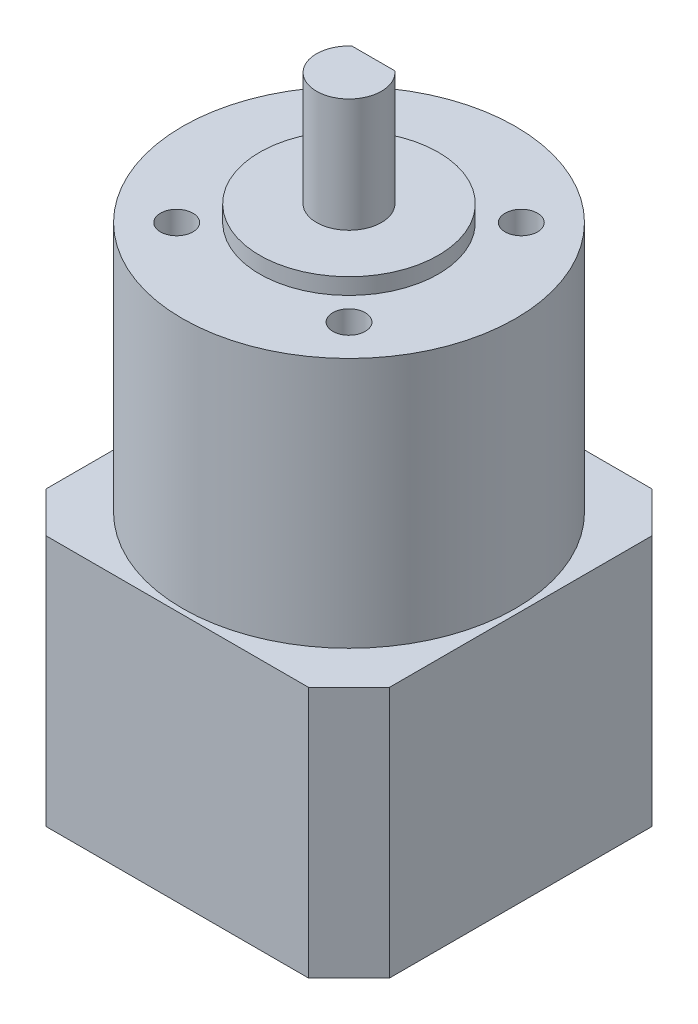
ISO-10303-21;
HEADER;
FILE_DESCRIPTION(('STEP AP214'),'2;1');
FILE_NAME('part.step','',(''),(''),'','','');
FILE_SCHEMA(('AUTOMOTIVE_DESIGN { 1 0 10303 214 1 1 1 1 }'));
ENDSEC;
DATA;
#1=APPLICATION_CONTEXT('core data for automotive mechanical design processes');
#2=APPLICATION_PROTOCOL_DEFINITION('international standard','automotive_design',2000,#1);
#3=PRODUCT_CONTEXT('',#1,'mechanical');
#4=PRODUCT('Part','Part','',(#3));
#5=PRODUCT_RELATED_PRODUCT_CATEGORY('part','',(#4));
#6=PRODUCT_DEFINITION_FORMATION('','',#4);
#7=PRODUCT_DEFINITION_CONTEXT('part definition',#1,'design');
#8=PRODUCT_DEFINITION('design','',#6,#7);
#9=PRODUCT_DEFINITION_SHAPE('','',#8);
#10=(LENGTH_UNIT() NAMED_UNIT(*) SI_UNIT(.MILLI.,.METRE.));
#11=(NAMED_UNIT(*) PLANE_ANGLE_UNIT() SI_UNIT($,.RADIAN.));
#12=(NAMED_UNIT(*) SI_UNIT($,.STERADIAN.) SOLID_ANGLE_UNIT());
#13=UNCERTAINTY_MEASURE_WITH_UNIT(LENGTH_MEASURE(1.E-05),#10,'distance_accuracy_value','');
#14=(GEOMETRIC_REPRESENTATION_CONTEXT(3) GLOBAL_UNCERTAINTY_ASSIGNED_CONTEXT((#13)) GLOBAL_UNIT_ASSIGNED_CONTEXT((#10,
#11,#12)) REPRESENTATION_CONTEXT('',''));
#15=CARTESIAN_POINT('',(0.,0.,0.));
#16=DIRECTION('',(0.,0.,1.));
#17=DIRECTION('',(1.,0.,0.));
#18=AXIS2_PLACEMENT_3D('',#15,#16,#17);
#19=CARTESIAN_POINT('',(0.,16.,0.));
#20=DIRECTION('',(0.,1.,0.));
#21=DIRECTION('',(0.,0.,1.));
#22=AXIS2_PLACEMENT_3D('',#19,#20,#21);
#23=PLANE('',#22);
#24=DIRECTION('',(1.,0.,0.));
#25=VECTOR('',#24,1.);
#26=CARTESIAN_POINT('',(-2.64575131106459,16.,-3.));
#27=LINE('',#26,#25);
#28=CARTESIAN_POINT('',(2.64575131106459,16.,-3.));
#29=VERTEX_POINT('',#28);
#30=CARTESIAN_POINT('',(-2.64575131106459,16.,-3.));
#31=VERTEX_POINT('',#30);
#32=EDGE_CURVE('E105',#29,#31,#27,.F.);
#33=ORIENTED_EDGE('',*,*,#32,.T.);
#34=CARTESIAN_POINT('',(0.,16.,0.));
#35=DIRECTION('',(0.,-1.,0.));
#36=DIRECTION('',(0.,0.,-1.));
#37=AXIS2_PLACEMENT_3D('',#34,#35,#36);
#38=CIRCLE('',#37,4.);
#39=EDGE_CURVE('E20',#29,#31,#38,.T.);
#40=ORIENTED_EDGE('',*,*,#39,.F.);
#41=EDGE_LOOP('',(#33,#40));
#42=FACE_BOUND('',#41,.T.);
#43=ADVANCED_FACE('F17',(#42),#23,.T.);
#44=CARTESIAN_POINT('',(0.,3.,0.));
#45=DIRECTION('',(0.,-1.,0.));
#46=DIRECTION('',(0.,0.,-1.));
#47=AXIS2_PLACEMENT_3D('',#44,#45,#46);
#48=PLANE('',#47);
#49=CARTESIAN_POINT('',(0.,3.,0.));
#50=DIRECTION('',(0.,-1.,0.));
#51=DIRECTION('',(0.,0.,-1.));
#52=AXIS2_PLACEMENT_3D('',#49,#50,#51);
#53=CIRCLE('',#52,4.);
#54=CARTESIAN_POINT('',(-2.64575131106459,3.,-3.));
#55=VERTEX_POINT('',#54);
#56=CARTESIAN_POINT('',(2.64575131106459,3.,-3.));
#57=VERTEX_POINT('',#56);
#58=EDGE_CURVE('E91',#55,#57,#53,.T.);
#59=ORIENTED_EDGE('',*,*,#58,.F.);
#60=DIRECTION('',(1.,0.,0.));
#61=VECTOR('',#60,1.);
#62=CARTESIAN_POINT('',(-2.64575131106459,3.,-3.));
#63=LINE('',#62,#61);
#64=EDGE_CURVE('E107',#55,#57,#63,.T.);
#65=ORIENTED_EDGE('',*,*,#64,.T.);
#66=EDGE_LOOP('',(#59,#65));
#67=FACE_BOUND('',#66,.T.);
#68=ADVANCED_FACE('F154',(#67),#48,.F.);
#69=CARTESIAN_POINT('',(-2.64575131106459,3.,-3.));
#70=DIRECTION('',(0.,0.,1.));
#71=DIRECTION('',(1.,0.,0.));
#72=AXIS2_PLACEMENT_3D('',#69,#70,#71);
#73=PLANE('',#72);
#74=DIRECTION('',(0.,-1.,0.));
#75=VECTOR('',#74,1.);
#76=CARTESIAN_POINT('',(2.64575131106459,16.,-3.));
#77=LINE('',#76,#75);
#78=EDGE_CURVE('E102',#57,#29,#77,.F.);
#79=ORIENTED_EDGE('',*,*,#78,.F.);
#80=ORIENTED_EDGE('',*,*,#64,.F.);
#81=DIRECTION('',(0.,-1.,0.));
#82=VECTOR('',#81,1.);
#83=CARTESIAN_POINT('',(-2.64575131106459,16.,-3.));
#84=LINE('',#83,#82);
#85=EDGE_CURVE('E100',#31,#55,#84,.T.);
#86=ORIENTED_EDGE('',*,*,#85,.F.);
#87=ORIENTED_EDGE('',*,*,#32,.F.);
#88=EDGE_LOOP('',(#79,#80,#86,#87));
#89=FACE_BOUND('',#88,.T.);
#90=ADVANCED_FACE('F109',(#89),#73,.F.);
#91=CARTESIAN_POINT('',(0.,16.,0.));
#92=DIRECTION('',(0.,-1.,0.));
#93=DIRECTION('',(0.,0.,-1.));
#94=AXIS2_PLACEMENT_3D('',#91,#92,#93);
#95=CYLINDRICAL_SURFACE('',#94,4.);
#96=CARTESIAN_POINT('',(0.,2.,0.));
#97=DIRECTION('',(0.,-1.,0.));
#98=DIRECTION('',(0.,0.,-1.));
#99=AXIS2_PLACEMENT_3D('',#96,#97,#98);
#100=CIRCLE('',#99,4.);
#101=CARTESIAN_POINT('',(0.,2.,-4.));
#102=VERTEX_POINT('',#101);
#103=EDGE_CURVE('E148',#102,#102,#100,.T.);
#104=ORIENTED_EDGE('',*,*,#103,.F.);
#105=EDGE_LOOP('',(#104));
#106=FACE_BOUND('',#105,.T.);
#107=ORIENTED_EDGE('',*,*,#58,.T.);
#108=ORIENTED_EDGE('',*,*,#78,.T.);
#109=ORIENTED_EDGE('',*,*,#39,.T.);
#110=ORIENTED_EDGE('',*,*,#85,.T.);
#111=EDGE_LOOP('',(#107,#108,#109,#110));
#112=FACE_BOUND('',#111,.T.);
#113=ADVANCED_FACE('F98',(#106,#112),#95,.T.);
#114=CARTESIAN_POINT('',(-16.15,-61.9,-16.15));
#115=DIRECTION('',(0.,-1.,0.));
#116=DIRECTION('',(0.,0.,-1.));
#117=AXIS2_PLACEMENT_3D('',#114,#115,#116);
#118=PLANE('',#117);
#119=DIRECTION('',(0.,0.,1.));
#120=VECTOR('',#119,1.);
#121=CARTESIAN_POINT('',(21.15,-61.9,16.15));
#122=LINE('',#121,#120);
#123=CARTESIAN_POINT('',(21.15,-61.9,-16.15));
#124=VERTEX_POINT('',#123);
#125=CARTESIAN_POINT('',(21.15,-61.9,16.1500000000001));
#126=VERTEX_POINT('',#125);
#127=EDGE_CURVE('E419',#124,#126,#122,.T.);
#128=ORIENTED_EDGE('',*,*,#127,.T.);
#129=DIRECTION('',(0.707106781186552,0.,-0.707106781186543));
#130=VECTOR('',#129,1.);
#131=CARTESIAN_POINT('',(21.1499999999999,-61.9,16.1500000000001));
#132=LINE('',#131,#130);
#133=CARTESIAN_POINT('',(16.1499999999999,-61.9,21.15));
#134=VERTEX_POINT('',#133);
#135=EDGE_CURVE('E422',#134,#126,#132,.T.);
#136=ORIENTED_EDGE('',*,*,#135,.F.);
#137=DIRECTION('',(-1.,0.,0.));
#138=VECTOR('',#137,1.);
#139=CARTESIAN_POINT('',(-16.15,-61.9,21.15));
#140=LINE('',#139,#138);
#141=CARTESIAN_POINT('',(-16.1500000000001,-61.9,21.15));
#142=VERTEX_POINT('',#141);
#143=EDGE_CURVE('E439',#134,#142,#140,.T.);
#144=ORIENTED_EDGE('',*,*,#143,.T.);
#145=DIRECTION('',(0.70710678118654,0.,0.707106781186555));
#146=VECTOR('',#145,1.);
#147=CARTESIAN_POINT('',(-16.1500000000002,-61.9,21.1499999999998));
#148=LINE('',#147,#146);
#149=CARTESIAN_POINT('',(-21.15,-61.9,16.1499999999999));
#150=VERTEX_POINT('',#149);
#151=EDGE_CURVE('E147',#150,#142,#148,.T.);
#152=ORIENTED_EDGE('',*,*,#151,.F.);
#153=DIRECTION('',(0.,0.,-1.));
#154=VECTOR('',#153,1.);
#155=CARTESIAN_POINT('',(-21.15,-61.9,16.15));
#156=LINE('',#155,#154);
#157=CARTESIAN_POINT('',(-21.15,-61.9,-16.1499999999999));
#158=VERTEX_POINT('',#157);
#159=EDGE_CURVE('E150',#150,#158,#156,.T.);
#160=ORIENTED_EDGE('',*,*,#159,.T.);
#161=DIRECTION('',(-0.707106781186548,0.,0.707106781186548));
#162=VECTOR('',#161,1.);
#163=CARTESIAN_POINT('',(-21.15,-61.9,-16.15));
#164=LINE('',#163,#162);
#165=CARTESIAN_POINT('',(-16.15,-61.9,-21.15));
#166=VERTEX_POINT('',#165);
#167=EDGE_CURVE('E453',#166,#158,#164,.T.);
#168=ORIENTED_EDGE('',*,*,#167,.F.);
#169=DIRECTION('',(1.,0.,0.));
#170=VECTOR('',#169,1.);
#171=CARTESIAN_POINT('',(-16.15,-61.9,-21.15));
#172=LINE('',#171,#170);
#173=CARTESIAN_POINT('',(16.15,-61.9,-21.15));
#174=VERTEX_POINT('',#173);
#175=EDGE_CURVE('E448',#166,#174,#172,.T.);
#176=ORIENTED_EDGE('',*,*,#175,.T.);
#177=DIRECTION('',(-0.707106781186545,0.,-0.70710678118655));
#178=VECTOR('',#177,1.);
#179=CARTESIAN_POINT('',(16.1500000000001,-61.9,-21.1499999999999));
#180=LINE('',#179,#178);
#181=EDGE_CURVE('E425',#124,#174,#180,.T.);
#182=ORIENTED_EDGE('',*,*,#181,.F.);
#183=EDGE_LOOP('',(#128,#136,#144,#152,#160,#168,#176,#182));
#184=FACE_BOUND('',#183,.T.);
#185=ADVANCED_FACE('F248',(#184),#118,.T.);
#186=CARTESIAN_POINT('',(-10.6066017177976,-5.,10.6066017177982));
#187=DIRECTION('',(0.,1.,0.));
#188=DIRECTION('',(0.,0.,1.));
#189=AXIS2_PLACEMENT_3D('',#186,#187,#188);
#190=PLANE('',#189);
#191=CARTESIAN_POINT('',(-10.6066017177976,-5.,10.6066017177982));
#192=DIRECTION('',(0.,1.,0.));
#193=DIRECTION('',(0.,0.,1.));
#194=AXIS2_PLACEMENT_3D('',#191,#192,#193);
#195=CIRCLE('',#194,2.);
#196=CARTESIAN_POINT('',(-10.6066017177976,-5.,12.6066017177982));
#197=VERTEX_POINT('',#196);
#198=EDGE_CURVE('E144',#197,#197,#195,.T.);
#199=ORIENTED_EDGE('',*,*,#198,.T.);
#200=EDGE_LOOP('',(#199));
#201=FACE_BOUND('',#200,.T.);
#202=ADVANCED_FACE('F244',(#201),#190,.T.);
#203=CARTESIAN_POINT('',(10.6066017177988,-5.,10.6066017177976));
#204=DIRECTION('',(0.,1.,0.));
#205=DIRECTION('',(0.,0.,1.));
#206=AXIS2_PLACEMENT_3D('',#203,#204,#205);
#207=PLANE('',#206);
#208=CARTESIAN_POINT('',(10.6066017177988,-5.,10.6066017177976));
#209=DIRECTION('',(0.,1.,0.));
#210=DIRECTION('',(0.,0.,1.));
#211=AXIS2_PLACEMENT_3D('',#208,#209,#210);
#212=CIRCLE('',#211,2.);
#213=CARTESIAN_POINT('',(10.6066017177988,-5.,12.6066017177976));
#214=VERTEX_POINT('',#213);
#215=EDGE_CURVE('E141',#214,#214,#212,.T.);
#216=ORIENTED_EDGE('',*,*,#215,.T.);
#217=EDGE_LOOP('',(#216));
#218=FACE_BOUND('',#217,.T.);
#219=ADVANCED_FACE('F240',(#218),#207,.T.);
#220=CARTESIAN_POINT('',(10.6066017177982,-5.,-10.6066017177988));
#221=DIRECTION('',(0.,1.,0.));
#222=DIRECTION('',(0.,0.,1.));
#223=AXIS2_PLACEMENT_3D('',#220,#221,#222);
#224=PLANE('',#223);
#225=CARTESIAN_POINT('',(10.6066017177982,-5.,-10.6066017177988));
#226=DIRECTION('',(0.,1.,0.));
#227=DIRECTION('',(0.,0.,1.));
#228=AXIS2_PLACEMENT_3D('',#225,#226,#227);
#229=CIRCLE('',#228,2.);
#230=CARTESIAN_POINT('',(10.6066017177982,-5.,-8.60660171779881));
#231=VERTEX_POINT('',#230);
#232=EDGE_CURVE('E138',#231,#231,#229,.T.);
#233=ORIENTED_EDGE('',*,*,#232,.T.);
#234=EDGE_LOOP('',(#233));
#235=FACE_BOUND('',#234,.T.);
#236=ADVANCED_FACE('F236',(#235),#224,.T.);
#237=CARTESIAN_POINT('',(-10.6066017177982,-5.,-10.6066017177982));
#238=DIRECTION('',(0.,1.,0.));
#239=DIRECTION('',(0.,0.,1.));
#240=AXIS2_PLACEMENT_3D('',#237,#238,#239);
#241=PLANE('',#240);
#242=CARTESIAN_POINT('',(-10.6066017177982,-5.,-10.6066017177982));
#243=DIRECTION('',(0.,1.,0.));
#244=DIRECTION('',(0.,0.,1.));
#245=AXIS2_PLACEMENT_3D('',#242,#243,#244);
#246=CIRCLE('',#245,2.);
#247=CARTESIAN_POINT('',(-10.6066017177982,-5.,-8.60660171779821));
#248=VERTEX_POINT('',#247);
#249=EDGE_CURVE('E135',#248,#248,#246,.T.);
#250=ORIENTED_EDGE('',*,*,#249,.T.);
#251=EDGE_LOOP('',(#250));
#252=FACE_BOUND('',#251,.T.);
#253=ADVANCED_FACE('F232',(#252),#241,.T.);
#254=CARTESIAN_POINT('',(0.,2.,0.));
#255=DIRECTION('',(0.,1.,0.));
#256=DIRECTION('',(0.,0.,1.));
#257=AXIS2_PLACEMENT_3D('',#254,#255,#256);
#258=PLANE('',#257);
#259=ORIENTED_EDGE('',*,*,#103,.T.);
#260=EDGE_LOOP('',(#259));
#261=FACE_BOUND('',#260,.T.);
#262=CARTESIAN_POINT('',(0.,2.,0.));
#263=DIRECTION('',(0.,-1.,0.));
#264=DIRECTION('',(0.,0.,-1.));
#265=AXIS2_PLACEMENT_3D('',#262,#263,#264);
#266=CIRCLE('',#265,11.);
#267=CARTESIAN_POINT('',(0.,2.,-11.));
#268=VERTEX_POINT('',#267);
#269=EDGE_CURVE('E131',#268,#268,#266,.T.);
#270=ORIENTED_EDGE('',*,*,#269,.F.);
#271=EDGE_LOOP('',(#270));
#272=FACE_BOUND('',#271,.T.);
#273=ADVANCED_FACE('F228',(#261,#272),#258,.T.);
#274=CARTESIAN_POINT('',(-21.15,-61.9,16.15));
#275=DIRECTION('',(1.,0.,0.));
#276=DIRECTION('',(0.,0.,-1.));
#277=AXIS2_PLACEMENT_3D('',#274,#275,#276);
#278=PLANE('',#277);
#279=DIRECTION('',(0.,1.,0.));
#280=VECTOR('',#279,1.);
#281=CARTESIAN_POINT('',(-21.15,-30.9,-16.15));
#282=LINE('',#281,#280);
#283=CARTESIAN_POINT('',(-21.15,-30.9,-16.15));
#284=VERTEX_POINT('',#283);
#285=EDGE_CURVE('E455',#158,#284,#282,.T.);
#286=ORIENTED_EDGE('',*,*,#285,.F.);
#287=ORIENTED_EDGE('',*,*,#159,.F.);
#288=DIRECTION('',(0.,1.,0.));
#289=VECTOR('',#288,1.);
#290=CARTESIAN_POINT('',(-21.15,-30.9,16.15));
#291=LINE('',#290,#289);
#292=CARTESIAN_POINT('',(-21.15,-30.9,16.15));
#293=VERTEX_POINT('',#292);
#294=EDGE_CURVE('E482',#293,#150,#291,.F.);
#295=ORIENTED_EDGE('',*,*,#294,.F.);
#296=DIRECTION('',(0.,0.,-1.));
#297=VECTOR('',#296,1.);
#298=CARTESIAN_POINT('',(-21.15,-30.9,-16.15));
#299=LINE('',#298,#297);
#300=EDGE_CURVE('E134',#293,#284,#299,.T.);
#301=ORIENTED_EDGE('',*,*,#300,.T.);
#302=EDGE_LOOP('',(#286,#287,#295,#301));
#303=FACE_BOUND('',#302,.T.);
#304=ADVANCED_FACE('F224',(#303),#278,.F.);
#305=CARTESIAN_POINT('',(-21.15,-30.9,-16.15));
#306=DIRECTION('',(-0.707106781186548,0.,-0.707106781186548));
#307=DIRECTION('',(-0.707106781186548,0.,0.707106781186548));
#308=AXIS2_PLACEMENT_3D('',#305,#306,#307);
#309=PLANE('',#308);
#310=DIRECTION('',(0.,1.,0.));
#311=VECTOR('',#310,1.);
#312=CARTESIAN_POINT('',(-16.15,-61.9,-21.15));
#313=LINE('',#312,#311);
#314=CARTESIAN_POINT('',(-16.15,-30.9,-21.15));
#315=VERTEX_POINT('',#314);
#316=EDGE_CURVE('E450',#315,#166,#313,.F.);
#317=ORIENTED_EDGE('',*,*,#316,.T.);
#318=ORIENTED_EDGE('',*,*,#167,.T.);
#319=ORIENTED_EDGE('',*,*,#285,.T.);
#320=DIRECTION('',(0.707106781186547,0.,-0.707106781186547));
#321=VECTOR('',#320,1.);
#322=CARTESIAN_POINT('',(-21.15,-30.9,-16.15));
#323=LINE('',#322,#321);
#324=EDGE_CURVE('E465',#284,#315,#323,.T.);
#325=ORIENTED_EDGE('',*,*,#324,.T.);
#326=EDGE_LOOP('',(#317,#318,#319,#325));
#327=FACE_BOUND('',#326,.T.);
#328=ADVANCED_FACE('F220',(#327),#309,.T.);
#329=CARTESIAN_POINT('',(-16.15,-61.9,-21.15));
#330=DIRECTION('',(0.,0.,1.));
#331=DIRECTION('',(1.,0.,0.));
#332=AXIS2_PLACEMENT_3D('',#329,#330,#331);
#333=PLANE('',#332);
#334=DIRECTION('',(0.,1.,0.));
#335=VECTOR('',#334,1.);
#336=CARTESIAN_POINT('',(16.1500000000001,-30.9,-21.1499999999999));
#337=LINE('',#336,#335);
#338=CARTESIAN_POINT('',(16.15,-30.9,-21.15));
#339=VERTEX_POINT('',#338);
#340=EDGE_CURVE('E445',#174,#339,#337,.T.);
#341=ORIENTED_EDGE('',*,*,#340,.F.);
#342=ORIENTED_EDGE('',*,*,#175,.F.);
#343=ORIENTED_EDGE('',*,*,#316,.F.);
#344=DIRECTION('',(1.,0.,0.));
#345=VECTOR('',#344,1.);
#346=CARTESIAN_POINT('',(-16.15,-30.9,-21.15));
#347=LINE('',#346,#345);
#348=EDGE_CURVE('E468',#315,#339,#347,.T.);
#349=ORIENTED_EDGE('',*,*,#348,.T.);
#350=EDGE_LOOP('',(#341,#342,#343,#349));
#351=FACE_BOUND('',#350,.T.);
#352=ADVANCED_FACE('F216',(#351),#333,.F.);
#353=CARTESIAN_POINT('',(16.1500000000001,-30.9,-21.1499999999999));
#354=DIRECTION('',(0.70710678118655,0.,-0.707106781186545));
#355=DIRECTION('',(-0.707106781186545,0.,-0.70710678118655));
#356=AXIS2_PLACEMENT_3D('',#353,#354,#355);
#357=PLANE('',#356);
#358=DIRECTION('',(0.,1.,0.));
#359=VECTOR('',#358,1.);
#360=CARTESIAN_POINT('',(21.15,-61.9,-16.15));
#361=LINE('',#360,#359);
#362=CARTESIAN_POINT('',(21.15,-30.9,-16.15));
#363=VERTEX_POINT('',#362);
#364=EDGE_CURVE('E429',#363,#124,#361,.F.);
#365=ORIENTED_EDGE('',*,*,#364,.T.);
#366=ORIENTED_EDGE('',*,*,#181,.T.);
#367=ORIENTED_EDGE('',*,*,#340,.T.);
#368=DIRECTION('',(0.707106781186548,0.,0.707106781186547));
#369=VECTOR('',#368,1.);
#370=CARTESIAN_POINT('',(16.1500000000001,-30.9,-21.1499999999999));
#371=LINE('',#370,#369);
#372=EDGE_CURVE('E470',#339,#363,#371,.T.);
#373=ORIENTED_EDGE('',*,*,#372,.T.);
#374=EDGE_LOOP('',(#365,#366,#367,#373));
#375=FACE_BOUND('',#374,.T.);
#376=ADVANCED_FACE('F212',(#375),#357,.T.);
#377=CARTESIAN_POINT('',(21.15,-61.9,16.15));
#378=DIRECTION('',(-1.,0.,0.));
#379=DIRECTION('',(0.,0.,1.));
#380=AXIS2_PLACEMENT_3D('',#377,#378,#379);
#381=PLANE('',#380);
#382=DIRECTION('',(0.,1.,0.));
#383=VECTOR('',#382,1.);
#384=CARTESIAN_POINT('',(21.1499999999999,-30.9,16.1500000000001));
#385=LINE('',#384,#383);
#386=CARTESIAN_POINT('',(21.15,-30.9,16.1500000000001));
#387=VERTEX_POINT('',#386);
#388=EDGE_CURVE('E428',#126,#387,#385,.T.);
#389=ORIENTED_EDGE('',*,*,#388,.F.);
#390=ORIENTED_EDGE('',*,*,#127,.F.);
#391=ORIENTED_EDGE('',*,*,#364,.F.);
#392=DIRECTION('',(0.,0.,-1.));
#393=VECTOR('',#392,1.);
#394=CARTESIAN_POINT('',(21.15,-30.9,-16.15));
#395=LINE('',#394,#393);
#396=EDGE_CURVE('E433',#363,#387,#395,.F.);
#397=ORIENTED_EDGE('',*,*,#396,.T.);
#398=EDGE_LOOP('',(#389,#390,#391,#397));
#399=FACE_BOUND('',#398,.T.);
#400=ADVANCED_FACE('F208',(#399),#381,.F.);
#401=CARTESIAN_POINT('',(21.1499999999999,-30.9,16.1500000000001));
#402=DIRECTION('',(0.707106781186543,0.,0.707106781186552));
#403=DIRECTION('',(0.707106781186552,0.,-0.707106781186543));
#404=AXIS2_PLACEMENT_3D('',#401,#402,#403);
#405=PLANE('',#404);
#406=DIRECTION('',(0.,1.,0.));
#407=VECTOR('',#406,1.);
#408=CARTESIAN_POINT('',(16.15,-61.9,21.15));
#409=LINE('',#408,#407);
#410=CARTESIAN_POINT('',(16.15,-30.9,21.15));
#411=VERTEX_POINT('',#410);
#412=EDGE_CURVE('E436',#411,#134,#409,.F.);
#413=ORIENTED_EDGE('',*,*,#412,.T.);
#414=ORIENTED_EDGE('',*,*,#135,.T.);
#415=ORIENTED_EDGE('',*,*,#388,.T.);
#416=DIRECTION('',(-0.707106781186548,0.,0.707106781186546));
#417=VECTOR('',#416,1.);
#418=CARTESIAN_POINT('',(21.1499999999999,-30.9,16.1500000000001));
#419=LINE('',#418,#417);
#420=EDGE_CURVE('E472',#387,#411,#419,.T.);
#421=ORIENTED_EDGE('',*,*,#420,.T.);
#422=EDGE_LOOP('',(#413,#414,#415,#421));
#423=FACE_BOUND('',#422,.T.);
#424=ADVANCED_FACE('F205',(#423),#405,.T.);
#425=CARTESIAN_POINT('',(-16.15,-61.9,21.15));
#426=DIRECTION('',(0.,0.,-1.));
#427=DIRECTION('',(-1.,0.,0.));
#428=AXIS2_PLACEMENT_3D('',#425,#426,#427);
#429=PLANE('',#428);
#430=DIRECTION('',(0.,1.,0.));
#431=VECTOR('',#430,1.);
#432=CARTESIAN_POINT('',(-16.1500000000002,-30.9,21.1499999999998));
#433=LINE('',#432,#431);
#434=CARTESIAN_POINT('',(-16.1500000000002,-30.9,21.15));
#435=VERTEX_POINT('',#434);
#436=EDGE_CURVE('E484',#142,#435,#433,.T.);
#437=ORIENTED_EDGE('',*,*,#436,.F.);
#438=ORIENTED_EDGE('',*,*,#143,.F.);
#439=ORIENTED_EDGE('',*,*,#412,.F.);
#440=DIRECTION('',(1.,0.,0.));
#441=VECTOR('',#440,1.);
#442=CARTESIAN_POINT('',(-16.15,-30.9,21.15));
#443=LINE('',#442,#441);
#444=EDGE_CURVE('E35',#411,#435,#443,.F.);
#445=ORIENTED_EDGE('',*,*,#444,.T.);
#446=EDGE_LOOP('',(#437,#438,#439,#445));
#447=FACE_BOUND('',#446,.T.);
#448=ADVANCED_FACE('F201',(#447),#429,.F.);
#449=CARTESIAN_POINT('',(-16.1500000000002,-30.9,21.1499999999998));
#450=DIRECTION('',(-0.707106781186555,0.,0.70710678118654));
#451=DIRECTION('',(0.70710678118654,0.,0.707106781186555));
#452=AXIS2_PLACEMENT_3D('',#449,#450,#451);
#453=PLANE('',#452);
#454=ORIENTED_EDGE('',*,*,#294,.T.);
#455=ORIENTED_EDGE('',*,*,#151,.T.);
#456=ORIENTED_EDGE('',*,*,#436,.T.);
#457=DIRECTION('',(-0.707106781186545,0.,-0.707106781186549));
#458=VECTOR('',#457,1.);
#459=CARTESIAN_POINT('',(-16.1500000000002,-30.9,21.1499999999998));
#460=LINE('',#459,#458);
#461=EDGE_CURVE('E130',#435,#293,#460,.T.);
#462=ORIENTED_EDGE('',*,*,#461,.T.);
#463=EDGE_LOOP('',(#454,#455,#456,#462));
#464=FACE_BOUND('',#463,.T.);
#465=ADVANCED_FACE('F197',(#464),#453,.T.);
#466=CARTESIAN_POINT('',(-10.6066017177976,-5.,10.6066017177982));
#467=DIRECTION('',(0.,1.,0.));
#468=DIRECTION('',(0.,0.,1.));
#469=AXIS2_PLACEMENT_3D('',#466,#467,#468);
#470=CYLINDRICAL_SURFACE('',#469,2.);
#471=ORIENTED_EDGE('',*,*,#198,.F.);
#472=EDGE_LOOP('',(#471));
#473=FACE_BOUND('',#472,.T.);
#474=CARTESIAN_POINT('',(-10.6066017177976,0.,10.6066017177982));
#475=DIRECTION('',(0.,1.,0.));
#476=DIRECTION('',(0.,0.,1.));
#477=AXIS2_PLACEMENT_3D('',#474,#475,#476);
#478=CIRCLE('',#477,2.);
#479=CARTESIAN_POINT('',(-10.6066017177976,0.,12.6066017177982));
#480=VERTEX_POINT('',#479);
#481=EDGE_CURVE('E127',#480,#480,#478,.T.);
#482=ORIENTED_EDGE('',*,*,#481,.T.);
#483=EDGE_LOOP('',(#482));
#484=FACE_BOUND('',#483,.T.);
#485=ADVANCED_FACE('F193',(#473,#484),#470,.F.);
#486=CARTESIAN_POINT('',(10.6066017177988,-5.,10.6066017177976));
#487=DIRECTION('',(0.,1.,0.));
#488=DIRECTION('',(0.,0.,1.));
#489=AXIS2_PLACEMENT_3D('',#486,#487,#488);
#490=CYLINDRICAL_SURFACE('',#489,2.);
#491=ORIENTED_EDGE('',*,*,#215,.F.);
#492=EDGE_LOOP('',(#491));
#493=FACE_BOUND('',#492,.T.);
#494=CARTESIAN_POINT('',(10.6066017177988,0.,10.6066017177976));
#495=DIRECTION('',(0.,1.,0.));
#496=DIRECTION('',(0.,0.,1.));
#497=AXIS2_PLACEMENT_3D('',#494,#495,#496);
#498=CIRCLE('',#497,2.);
#499=CARTESIAN_POINT('',(10.6066017177988,0.,12.6066017177976));
#500=VERTEX_POINT('',#499);
#501=EDGE_CURVE('E124',#500,#500,#498,.T.);
#502=ORIENTED_EDGE('',*,*,#501,.T.);
#503=EDGE_LOOP('',(#502));
#504=FACE_BOUND('',#503,.T.);
#505=ADVANCED_FACE('F189',(#493,#504),#490,.F.);
#506=CARTESIAN_POINT('',(10.6066017177982,-5.,-10.6066017177988));
#507=DIRECTION('',(0.,1.,0.));
#508=DIRECTION('',(0.,0.,1.));
#509=AXIS2_PLACEMENT_3D('',#506,#507,#508);
#510=CYLINDRICAL_SURFACE('',#509,2.);
#511=ORIENTED_EDGE('',*,*,#232,.F.);
#512=EDGE_LOOP('',(#511));
#513=FACE_BOUND('',#512,.T.);
#514=CARTESIAN_POINT('',(10.6066017177982,0.,-10.6066017177988));
#515=DIRECTION('',(0.,1.,0.));
#516=DIRECTION('',(0.,0.,1.));
#517=AXIS2_PLACEMENT_3D('',#514,#515,#516);
#518=CIRCLE('',#517,2.);
#519=CARTESIAN_POINT('',(10.6066017177982,0.,-8.60660171779881));
#520=VERTEX_POINT('',#519);
#521=EDGE_CURVE('E121',#520,#520,#518,.T.);
#522=ORIENTED_EDGE('',*,*,#521,.T.);
#523=EDGE_LOOP('',(#522));
#524=FACE_BOUND('',#523,.T.);
#525=ADVANCED_FACE('F185',(#513,#524),#510,.F.);
#526=CARTESIAN_POINT('',(-10.6066017177982,-5.,-10.6066017177982));
#527=DIRECTION('',(0.,1.,0.));
#528=DIRECTION('',(0.,0.,1.));
#529=AXIS2_PLACEMENT_3D('',#526,#527,#528);
#530=CYLINDRICAL_SURFACE('',#529,2.);
#531=ORIENTED_EDGE('',*,*,#249,.F.);
#532=EDGE_LOOP('',(#531));
#533=FACE_BOUND('',#532,.T.);
#534=CARTESIAN_POINT('',(-10.6066017177982,0.,-10.6066017177982));
#535=DIRECTION('',(0.,1.,0.));
#536=DIRECTION('',(0.,0.,1.));
#537=AXIS2_PLACEMENT_3D('',#534,#535,#536);
#538=CIRCLE('',#537,2.);
#539=CARTESIAN_POINT('',(-10.6066017177982,0.,-8.60660171779821));
#540=VERTEX_POINT('',#539);
#541=EDGE_CURVE('E118',#540,#540,#538,.T.);
#542=ORIENTED_EDGE('',*,*,#541,.T.);
#543=EDGE_LOOP('',(#542));
#544=FACE_BOUND('',#543,.T.);
#545=ADVANCED_FACE('F181',(#533,#544),#530,.F.);
#546=CARTESIAN_POINT('',(0.,2.,0.));
#547=DIRECTION('',(0.,-1.,0.));
#548=DIRECTION('',(0.,0.,-1.));
#549=AXIS2_PLACEMENT_3D('',#546,#547,#548);
#550=CYLINDRICAL_SURFACE('',#549,11.);
#551=CARTESIAN_POINT('',(0.,0.,0.));
#552=DIRECTION('',(0.,-1.,0.));
#553=DIRECTION('',(0.,0.,-1.));
#554=AXIS2_PLACEMENT_3D('',#551,#552,#553);
#555=CIRCLE('',#554,11.);
#556=CARTESIAN_POINT('',(0.,0.,-11.));
#557=VERTEX_POINT('',#556);
#558=EDGE_CURVE('E115',#557,#557,#555,.F.);
#559=ORIENTED_EDGE('',*,*,#558,.T.);
#560=EDGE_LOOP('',(#559));
#561=FACE_BOUND('',#560,.T.);
#562=ORIENTED_EDGE('',*,*,#269,.T.);
#563=EDGE_LOOP('',(#562));
#564=FACE_BOUND('',#563,.T.);
#565=ADVANCED_FACE('F177',(#561,#564),#550,.T.);
#566=CARTESIAN_POINT('',(-16.15,-30.9,-16.15));
#567=DIRECTION('',(0.,-1.,0.));
#568=DIRECTION('',(0.,0.,-1.));
#569=AXIS2_PLACEMENT_3D('',#566,#567,#568);
#570=PLANE('',#569);
#571=ORIENTED_EDGE('',*,*,#444,.F.);
#572=ORIENTED_EDGE('',*,*,#420,.F.);
#573=ORIENTED_EDGE('',*,*,#396,.F.);
#574=ORIENTED_EDGE('',*,*,#372,.F.);
#575=ORIENTED_EDGE('',*,*,#348,.F.);
#576=ORIENTED_EDGE('',*,*,#324,.F.);
#577=ORIENTED_EDGE('',*,*,#300,.F.);
#578=ORIENTED_EDGE('',*,*,#461,.F.);
#579=EDGE_LOOP('',(#571,#572,#573,#574,#575,#576,#577,#578));
#580=FACE_BOUND('',#579,.T.);
#581=CARTESIAN_POINT('',(0.,-30.9,0.));
#582=DIRECTION('',(0.,1.,0.));
#583=DIRECTION('',(0.,0.,1.));
#584=AXIS2_PLACEMENT_3D('',#581,#582,#583);
#585=CIRCLE('',#584,20.5);
#586=CARTESIAN_POINT('',(0.,-30.9,20.5));
#587=VERTEX_POINT('',#586);
#588=EDGE_CURVE('E26',#587,#587,#585,.T.);
#589=ORIENTED_EDGE('',*,*,#588,.F.);
#590=EDGE_LOOP('',(#589));
#591=FACE_BOUND('',#590,.T.);
#592=ADVANCED_FACE('F170',(#580,#591),#570,.F.);
#593=CARTESIAN_POINT('',(0.,0.,0.));
#594=DIRECTION('',(0.,-1.,0.));
#595=DIRECTION('',(0.,0.,-1.));
#596=AXIS2_PLACEMENT_3D('',#593,#594,#595);
#597=PLANE('',#596);
#598=ORIENTED_EDGE('',*,*,#558,.F.);
#599=EDGE_LOOP('',(#598));
#600=FACE_BOUND('',#599,.T.);
#601=CARTESIAN_POINT('',(0.,0.,0.));
#602=DIRECTION('',(0.,1.,0.));
#603=DIRECTION('',(0.,0.,1.));
#604=AXIS2_PLACEMENT_3D('',#601,#602,#603);
#605=CIRCLE('',#604,20.5);
#606=CARTESIAN_POINT('',(0.,0.,20.5));
#607=VERTEX_POINT('',#606);
#608=EDGE_CURVE('E11',#607,#607,#605,.F.);
#609=ORIENTED_EDGE('',*,*,#608,.F.);
#610=EDGE_LOOP('',(#609));
#611=FACE_BOUND('',#610,.T.);
#612=ORIENTED_EDGE('',*,*,#541,.F.);
#613=EDGE_LOOP('',(#612));
#614=FACE_BOUND('',#613,.T.);
#615=ORIENTED_EDGE('',*,*,#521,.F.);
#616=EDGE_LOOP('',(#615));
#617=FACE_BOUND('',#616,.T.);
#618=ORIENTED_EDGE('',*,*,#501,.F.);
#619=EDGE_LOOP('',(#618));
#620=FACE_BOUND('',#619,.T.);
#621=ORIENTED_EDGE('',*,*,#481,.F.);
#622=EDGE_LOOP('',(#621));
#623=FACE_BOUND('',#622,.T.);
#624=ADVANCED_FACE('F164',(#600,#611,#614,#617,#620,#623),#597,.F.);
#625=CARTESIAN_POINT('',(0.,-30.9,0.));
#626=DIRECTION('',(0.,1.,0.));
#627=DIRECTION('',(0.,0.,1.));
#628=AXIS2_PLACEMENT_3D('',#625,#626,#627);
#629=CYLINDRICAL_SURFACE('',#628,20.5);
#630=ORIENTED_EDGE('',*,*,#588,.T.);
#631=EDGE_LOOP('',(#630));
#632=FACE_BOUND('',#631,.T.);
#633=ORIENTED_EDGE('',*,*,#608,.T.);
#634=EDGE_LOOP('',(#633));
#635=FACE_BOUND('',#634,.T.);
#636=ADVANCED_FACE('F162',(#632,#635),#629,.T.);
#637=CLOSED_SHELL('',(#43,#68,#90,#113,#185,#202,#219,#236,#253,#273,#304,#328,#352,#376,#400,
#424,#448,#465,#485,#505,#525,#545,#565,#592,#624,#636));
#638=MANIFOLD_SOLID_BREP('B1',#637);
#639=ADVANCED_BREP_SHAPE_REPRESENTATION('',(#18,#638),#14);
#640=SHAPE_DEFINITION_REPRESENTATION(#9,#639);
ENDSEC;
END-ISO-10303-21;
